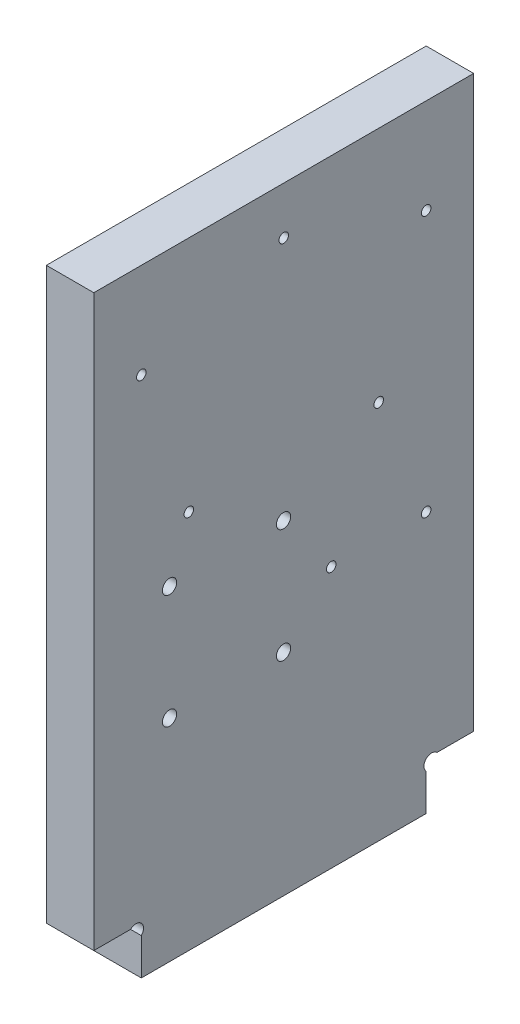
ISO-10303-21;
HEADER;
FILE_DESCRIPTION(('STEP AP214'),'2;1');
FILE_NAME('part.step','',(''),(''),'','','');
FILE_SCHEMA(('AUTOMOTIVE_DESIGN { 1 0 10303 214 1 1 1 1 }'));
ENDSEC;
DATA;
#1=APPLICATION_CONTEXT('core data for automotive mechanical design processes');
#2=APPLICATION_PROTOCOL_DEFINITION('international standard','automotive_design',2000,#1);
#3=PRODUCT_CONTEXT('',#1,'mechanical');
#4=PRODUCT('Part','Part','',(#3));
#5=PRODUCT_RELATED_PRODUCT_CATEGORY('part','',(#4));
#6=PRODUCT_DEFINITION_FORMATION('','',#4);
#7=PRODUCT_DEFINITION_CONTEXT('part definition',#1,'design');
#8=PRODUCT_DEFINITION('design','',#6,#7);
#9=PRODUCT_DEFINITION_SHAPE('','',#8);
#10=(LENGTH_UNIT() NAMED_UNIT(*) SI_UNIT(.MILLI.,.METRE.));
#11=(NAMED_UNIT(*) PLANE_ANGLE_UNIT() SI_UNIT($,.RADIAN.));
#12=(NAMED_UNIT(*) SI_UNIT($,.STERADIAN.) SOLID_ANGLE_UNIT());
#13=UNCERTAINTY_MEASURE_WITH_UNIT(LENGTH_MEASURE(1.E-05),#10,'distance_accuracy_value','');
#14=(GEOMETRIC_REPRESENTATION_CONTEXT(3) GLOBAL_UNCERTAINTY_ASSIGNED_CONTEXT((#13)) GLOBAL_UNIT_ASSIGNED_CONTEXT((#10,
#11,#12)) REPRESENTATION_CONTEXT('',''));
#15=CARTESIAN_POINT('',(0.,0.,0.));
#16=DIRECTION('',(0.,0.,1.));
#17=DIRECTION('',(1.,0.,0.));
#18=AXIS2_PLACEMENT_3D('',#15,#16,#17);
#19=CARTESIAN_POINT('',(10.,8.86862915010153,-8.86862915010152));
#20=DIRECTION('',(-1.,0.,0.));
#21=DIRECTION('',(0.,0.,1.));
#22=AXIS2_PLACEMENT_3D('',#19,#20,#21);
#23=CYLINDRICAL_SURFACE('',#22,1.6);
#24=CARTESIAN_POINT('',(0.,8.86862915010153,-8.86862915010152));
#25=DIRECTION('',(-1.,0.,0.));
#26=DIRECTION('',(0.,0.,-1.));
#27=AXIS2_PLACEMENT_3D('',#24,#25,#26);
#28=CIRCLE('',#27,1.6);
#29=CARTESIAN_POINT('',(0.,10.,-7.73725830020304));
#30=VERTEX_POINT('',#29);
#31=CARTESIAN_POINT('',(0.,7.73725830020305,-10.));
#32=VERTEX_POINT('',#31);
#33=EDGE_CURVE('E143',#30,#32,#28,.T.);
#34=ORIENTED_EDGE('',*,*,#33,.T.);
#35=DIRECTION('',(-1.,0.,0.));
#36=VECTOR('',#35,1.);
#37=CARTESIAN_POINT('',(10.,7.73725830020305,-10.));
#38=LINE('',#37,#36);
#39=CARTESIAN_POINT('',(10.,7.73725830020305,-10.));
#40=VERTEX_POINT('',#39);
#41=EDGE_CURVE('E11',#40,#32,#38,.T.);
#42=ORIENTED_EDGE('',*,*,#41,.F.);
#43=CARTESIAN_POINT('',(10.,8.86862915010153,-8.86862915010152));
#44=DIRECTION('',(-1.,0.,0.));
#45=DIRECTION('',(0.,0.,-1.));
#46=AXIS2_PLACEMENT_3D('',#43,#44,#45);
#47=CIRCLE('',#46,1.6);
#48=CARTESIAN_POINT('',(10.,10.,-7.73725830020304));
#49=VERTEX_POINT('',#48);
#50=EDGE_CURVE('E162',#49,#40,#47,.T.);
#51=ORIENTED_EDGE('',*,*,#50,.F.);
#52=DIRECTION('',(-1.,0.,0.));
#53=VECTOR('',#52,1.);
#54=CARTESIAN_POINT('',(10.,10.,-7.73725830020304));
#55=LINE('',#54,#53);
#56=EDGE_CURVE('E139',#49,#30,#55,.T.);
#57=ORIENTED_EDGE('',*,*,#56,.T.);
#58=EDGE_LOOP('',(#34,#42,#51,#57));
#59=FACE_BOUND('',#58,.T.);
#60=ADVANCED_FACE('F35',(#59),#23,.F.);
#61=CARTESIAN_POINT('',(10.,7.73725830020305,-10.));
#62=DIRECTION('',(0.,0.,-1.));
#63=DIRECTION('',(-1.,0.,0.));
#64=AXIS2_PLACEMENT_3D('',#61,#62,#63);
#65=PLANE('',#64);
#66=DIRECTION('',(0.,-1.,0.));
#67=VECTOR('',#66,1.);
#68=CARTESIAN_POINT('',(0.,7.73725830020305,-10.));
#69=LINE('',#68,#67);
#70=CARTESIAN_POINT('',(0.,0.,-10.));
#71=VERTEX_POINT('',#70);
#72=EDGE_CURVE('E146',#32,#71,#69,.T.);
#73=ORIENTED_EDGE('',*,*,#72,.T.);
#74=DIRECTION('',(-1.,0.,0.));
#75=VECTOR('',#74,1.);
#76=CARTESIAN_POINT('',(10.,0.,-10.));
#77=LINE('',#76,#75);
#78=CARTESIAN_POINT('',(10.,0.,-10.));
#79=VERTEX_POINT('',#78);
#80=EDGE_CURVE('E43',#79,#71,#77,.T.);
#81=ORIENTED_EDGE('',*,*,#80,.F.);
#82=DIRECTION('',(0.,-1.,0.));
#83=VECTOR('',#82,1.);
#84=CARTESIAN_POINT('',(10.,7.73725830020305,-10.));
#85=LINE('',#84,#83);
#86=EDGE_CURVE('E100',#40,#79,#85,.T.);
#87=ORIENTED_EDGE('',*,*,#86,.F.);
#88=ORIENTED_EDGE('',*,*,#41,.T.);
#89=EDGE_LOOP('',(#73,#81,#87,#88));
#90=FACE_BOUND('',#89,.T.);
#91=ADVANCED_FACE('F323',(#90),#65,.F.);
#92=CARTESIAN_POINT('',(10.,0.,-10.));
#93=DIRECTION('',(0.,1.,0.));
#94=DIRECTION('',(0.,0.,1.));
#95=AXIS2_PLACEMENT_3D('',#92,#93,#94);
#96=PLANE('',#95);
#97=DIRECTION('',(0.,0.,-1.));
#98=VECTOR('',#97,1.);
#99=CARTESIAN_POINT('',(0.,0.,-10.));
#100=LINE('',#99,#98);
#101=CARTESIAN_POINT('',(0.,0.,-70.));
#102=VERTEX_POINT('',#101);
#103=EDGE_CURVE('E149',#71,#102,#100,.T.);
#104=ORIENTED_EDGE('',*,*,#103,.T.);
#105=DIRECTION('',(-1.,0.,0.));
#106=VECTOR('',#105,1.);
#107=CARTESIAN_POINT('',(10.,0.,-70.));
#108=LINE('',#107,#106);
#109=CARTESIAN_POINT('',(10.,0.,-70.));
#110=VERTEX_POINT('',#109);
#111=EDGE_CURVE('E175',#110,#102,#108,.T.);
#112=ORIENTED_EDGE('',*,*,#111,.F.);
#113=DIRECTION('',(0.,0.,-1.));
#114=VECTOR('',#113,1.);
#115=CARTESIAN_POINT('',(10.,0.,-10.));
#116=LINE('',#115,#114);
#117=EDGE_CURVE('E183',#79,#110,#116,.T.);
#118=ORIENTED_EDGE('',*,*,#117,.F.);
#119=ORIENTED_EDGE('',*,*,#80,.T.);
#120=EDGE_LOOP('',(#104,#112,#118,#119));
#121=FACE_BOUND('',#120,.T.);
#122=ADVANCED_FACE('F181',(#121),#96,.F.);
#123=CARTESIAN_POINT('',(10.,7.73725830020305,-70.));
#124=DIRECTION('',(0.,0.,1.));
#125=DIRECTION('',(1.,0.,0.));
#126=AXIS2_PLACEMENT_3D('',#123,#124,#125);
#127=PLANE('',#126);
#128=DIRECTION('',(0.,1.,0.));
#129=VECTOR('',#128,1.);
#130=CARTESIAN_POINT('',(0.,7.73725830020305,-70.));
#131=LINE('',#130,#129);
#132=CARTESIAN_POINT('',(0.,7.73725830020305,-70.));
#133=VERTEX_POINT('',#132);
#134=EDGE_CURVE('E151',#102,#133,#131,.T.);
#135=ORIENTED_EDGE('',*,*,#134,.T.);
#136=DIRECTION('',(-1.,0.,0.));
#137=VECTOR('',#136,1.);
#138=CARTESIAN_POINT('',(10.,7.73725830020305,-70.));
#139=LINE('',#138,#137);
#140=CARTESIAN_POINT('',(10.,7.73725830020305,-70.));
#141=VERTEX_POINT('',#140);
#142=EDGE_CURVE('E172',#141,#133,#139,.T.);
#143=ORIENTED_EDGE('',*,*,#142,.F.);
#144=DIRECTION('',(0.,1.,0.));
#145=VECTOR('',#144,1.);
#146=CARTESIAN_POINT('',(10.,7.73725830020305,-70.));
#147=LINE('',#146,#145);
#148=EDGE_CURVE('E201',#110,#141,#147,.T.);
#149=ORIENTED_EDGE('',*,*,#148,.F.);
#150=ORIENTED_EDGE('',*,*,#111,.T.);
#151=EDGE_LOOP('',(#135,#143,#149,#150));
#152=FACE_BOUND('',#151,.T.);
#153=ADVANCED_FACE('F192',(#152),#127,.F.);
#154=CARTESIAN_POINT('',(10.,8.86862915010153,-71.1313708498985));
#155=DIRECTION('',(-1.,0.,0.));
#156=DIRECTION('',(0.,0.,1.));
#157=AXIS2_PLACEMENT_3D('',#154,#155,#156);
#158=CYLINDRICAL_SURFACE('',#157,1.6);
#159=CARTESIAN_POINT('',(0.,8.86862915010153,-71.1313708498985));
#160=DIRECTION('',(-1.,0.,0.));
#161=DIRECTION('',(0.,0.,1.));
#162=AXIS2_PLACEMENT_3D('',#159,#160,#161);
#163=CIRCLE('',#162,1.6);
#164=CARTESIAN_POINT('',(0.,10.,-72.262741699797));
#165=VERTEX_POINT('',#164);
#166=EDGE_CURVE('E153',#133,#165,#163,.T.);
#167=ORIENTED_EDGE('',*,*,#166,.T.);
#168=DIRECTION('',(-1.,0.,0.));
#169=VECTOR('',#168,1.);
#170=CARTESIAN_POINT('',(10.,10.,-72.262741699797));
#171=LINE('',#170,#169);
#172=CARTESIAN_POINT('',(10.,10.,-72.262741699797));
#173=VERTEX_POINT('',#172);
#174=EDGE_CURVE('E169',#173,#165,#171,.T.);
#175=ORIENTED_EDGE('',*,*,#174,.F.);
#176=CARTESIAN_POINT('',(10.,8.86862915010153,-71.1313708498985));
#177=DIRECTION('',(-1.,0.,0.));
#178=DIRECTION('',(0.,0.,1.));
#179=AXIS2_PLACEMENT_3D('',#176,#177,#178);
#180=CIRCLE('',#179,1.6);
#181=EDGE_CURVE('E198',#141,#173,#180,.T.);
#182=ORIENTED_EDGE('',*,*,#181,.F.);
#183=ORIENTED_EDGE('',*,*,#142,.T.);
#184=EDGE_LOOP('',(#167,#175,#182,#183));
#185=FACE_BOUND('',#184,.T.);
#186=ADVANCED_FACE('F196',(#185),#158,.F.);
#187=CARTESIAN_POINT('',(10.,10.,-72.262741699797));
#188=DIRECTION('',(0.,1.,0.));
#189=DIRECTION('',(0.,0.,1.));
#190=AXIS2_PLACEMENT_3D('',#187,#188,#189);
#191=PLANE('',#190);
#192=DIRECTION('',(0.,0.,-1.));
#193=VECTOR('',#192,1.);
#194=CARTESIAN_POINT('',(0.,10.,-72.262741699797));
#195=LINE('',#194,#193);
#196=CARTESIAN_POINT('',(0.,10.,-80.));
#197=VERTEX_POINT('',#196);
#198=EDGE_CURVE('E155',#165,#197,#195,.T.);
#199=ORIENTED_EDGE('',*,*,#198,.T.);
#200=DIRECTION('',(-1.,0.,0.));
#201=VECTOR('',#200,1.);
#202=CARTESIAN_POINT('',(10.,10.,-80.));
#203=LINE('',#202,#201);
#204=CARTESIAN_POINT('',(10.,10.,-80.));
#205=VERTEX_POINT('',#204);
#206=EDGE_CURVE('E166',#205,#197,#203,.T.);
#207=ORIENTED_EDGE('',*,*,#206,.F.);
#208=DIRECTION('',(0.,0.,-1.));
#209=VECTOR('',#208,1.);
#210=CARTESIAN_POINT('',(10.,10.,-72.262741699797));
#211=LINE('',#210,#209);
#212=EDGE_CURVE('E200',#173,#205,#211,.T.);
#213=ORIENTED_EDGE('',*,*,#212,.F.);
#214=ORIENTED_EDGE('',*,*,#174,.T.);
#215=EDGE_LOOP('',(#199,#207,#213,#214));
#216=FACE_BOUND('',#215,.T.);
#217=ADVANCED_FACE('F335',(#216),#191,.F.);
#218=CARTESIAN_POINT('',(10.,130.,-80.));
#219=DIRECTION('',(0.,0.,1.));
#220=DIRECTION('',(1.,0.,0.));
#221=AXIS2_PLACEMENT_3D('',#218,#219,#220);
#222=PLANE('',#221);
#223=DIRECTION('',(0.,1.,0.));
#224=VECTOR('',#223,1.);
#225=CARTESIAN_POINT('',(0.,130.,-80.));
#226=LINE('',#225,#224);
#227=CARTESIAN_POINT('',(0.,130.,-80.));
#228=VERTEX_POINT('',#227);
#229=EDGE_CURVE('E157',#197,#228,#226,.T.);
#230=ORIENTED_EDGE('',*,*,#229,.T.);
#231=DIRECTION('',(-1.,0.,0.));
#232=VECTOR('',#231,1.);
#233=CARTESIAN_POINT('',(10.,130.,-80.));
#234=LINE('',#233,#232);
#235=CARTESIAN_POINT('',(10.,130.,-80.));
#236=VERTEX_POINT('',#235);
#237=EDGE_CURVE('E134',#236,#228,#234,.T.);
#238=ORIENTED_EDGE('',*,*,#237,.F.);
#239=DIRECTION('',(0.,1.,0.));
#240=VECTOR('',#239,1.);
#241=CARTESIAN_POINT('',(10.,130.,-80.));
#242=LINE('',#241,#240);
#243=EDGE_CURVE('E125',#205,#236,#242,.T.);
#244=ORIENTED_EDGE('',*,*,#243,.F.);
#245=ORIENTED_EDGE('',*,*,#206,.T.);
#246=EDGE_LOOP('',(#230,#238,#244,#245));
#247=FACE_BOUND('',#246,.T.);
#248=ADVANCED_FACE('F332',(#247),#222,.F.);
#249=CARTESIAN_POINT('',(10.,130.,0.));
#250=DIRECTION('',(0.,-1.,0.));
#251=DIRECTION('',(0.,0.,-1.));
#252=AXIS2_PLACEMENT_3D('',#249,#250,#251);
#253=PLANE('',#252);
#254=DIRECTION('',(0.,0.,1.));
#255=VECTOR('',#254,1.);
#256=CARTESIAN_POINT('',(0.,130.,0.));
#257=LINE('',#256,#255);
#258=CARTESIAN_POINT('',(0.,130.,0.));
#259=VERTEX_POINT('',#258);
#260=EDGE_CURVE('E133',#228,#259,#257,.T.);
#261=ORIENTED_EDGE('',*,*,#260,.T.);
#262=DIRECTION('',(-1.,0.,0.));
#263=VECTOR('',#262,1.);
#264=CARTESIAN_POINT('',(10.,130.,0.));
#265=LINE('',#264,#263);
#266=CARTESIAN_POINT('',(10.,130.,0.));
#267=VERTEX_POINT('',#266);
#268=EDGE_CURVE('E130',#267,#259,#265,.T.);
#269=ORIENTED_EDGE('',*,*,#268,.F.);
#270=DIRECTION('',(0.,0.,1.));
#271=VECTOR('',#270,1.);
#272=CARTESIAN_POINT('',(10.,130.,0.));
#273=LINE('',#272,#271);
#274=EDGE_CURVE('E119',#236,#267,#273,.T.);
#275=ORIENTED_EDGE('',*,*,#274,.F.);
#276=ORIENTED_EDGE('',*,*,#237,.T.);
#277=EDGE_LOOP('',(#261,#269,#275,#276));
#278=FACE_BOUND('',#277,.T.);
#279=ADVANCED_FACE('F131',(#278),#253,.F.);
#280=CARTESIAN_POINT('',(10.,10.,0.));
#281=DIRECTION('',(0.,0.,-1.));
#282=DIRECTION('',(-1.,0.,0.));
#283=AXIS2_PLACEMENT_3D('',#280,#281,#282);
#284=PLANE('',#283);
#285=DIRECTION('',(0.,-1.,0.));
#286=VECTOR('',#285,1.);
#287=CARTESIAN_POINT('',(0.,10.,0.));
#288=LINE('',#287,#286);
#289=CARTESIAN_POINT('',(0.,10.,0.));
#290=VERTEX_POINT('',#289);
#291=EDGE_CURVE('E86',#259,#290,#288,.T.);
#292=ORIENTED_EDGE('',*,*,#291,.T.);
#293=DIRECTION('',(-1.,0.,0.));
#294=VECTOR('',#293,1.);
#295=CARTESIAN_POINT('',(10.,10.,0.));
#296=LINE('',#295,#294);
#297=CARTESIAN_POINT('',(10.,10.,0.));
#298=VERTEX_POINT('',#297);
#299=EDGE_CURVE('E135',#298,#290,#296,.T.);
#300=ORIENTED_EDGE('',*,*,#299,.F.);
#301=DIRECTION('',(0.,-1.,0.));
#302=VECTOR('',#301,1.);
#303=CARTESIAN_POINT('',(10.,10.,0.));
#304=LINE('',#303,#302);
#305=EDGE_CURVE('E123',#267,#298,#304,.T.);
#306=ORIENTED_EDGE('',*,*,#305,.F.);
#307=ORIENTED_EDGE('',*,*,#268,.T.);
#308=EDGE_LOOP('',(#292,#300,#306,#307));
#309=FACE_BOUND('',#308,.T.);
#310=ADVANCED_FACE('F137',(#309),#284,.F.);
#311=CARTESIAN_POINT('',(10.,10.,-7.73725830020304));
#312=DIRECTION('',(0.,1.,0.));
#313=DIRECTION('',(0.,0.,1.));
#314=AXIS2_PLACEMENT_3D('',#311,#312,#313);
#315=PLANE('',#314);
#316=DIRECTION('',(0.,0.,-1.));
#317=VECTOR('',#316,1.);
#318=CARTESIAN_POINT('',(0.,10.,-7.73725830020304));
#319=LINE('',#318,#317);
#320=EDGE_CURVE('E92',#290,#30,#319,.T.);
#321=ORIENTED_EDGE('',*,*,#320,.T.);
#322=ORIENTED_EDGE('',*,*,#56,.F.);
#323=DIRECTION('',(0.,0.,-1.));
#324=VECTOR('',#323,1.);
#325=CARTESIAN_POINT('',(10.,10.,-7.73725830020304));
#326=LINE('',#325,#324);
#327=EDGE_CURVE('E51',#298,#49,#326,.T.);
#328=ORIENTED_EDGE('',*,*,#327,.F.);
#329=ORIENTED_EDGE('',*,*,#299,.T.);
#330=EDGE_LOOP('',(#321,#322,#328,#329));
#331=FACE_BOUND('',#330,.T.);
#332=ADVANCED_FACE('F286',(#331),#315,.F.);
#333=CARTESIAN_POINT('',(10.,8.86862915010153,-8.86862915010152));
#334=DIRECTION('',(1.,0.,0.));
#335=DIRECTION('',(0.,0.,-1.));
#336=AXIS2_PLACEMENT_3D('',#333,#334,#335);
#337=PLANE('',#336);
#338=CARTESIAN_POINT('',(10.,68.45,-39.95));
#339=DIRECTION('',(1.,0.,0.));
#340=DIRECTION('',(0.,0.,-1.));
#341=AXIS2_PLACEMENT_3D('',#338,#339,#340);
#342=CIRCLE('',#341,1.5);
#343=CARTESIAN_POINT('',(10.,68.45,-41.45));
#344=VERTEX_POINT('',#343);
#345=EDGE_CURVE('E269',#344,#344,#342,.T.);
#346=ORIENTED_EDGE('',*,*,#345,.F.);
#347=EDGE_LOOP('',(#346));
#348=FACE_BOUND('',#347,.T.);
#349=CARTESIAN_POINT('',(10.,44.45,-39.95));
#350=DIRECTION('',(1.,0.,0.));
#351=DIRECTION('',(0.,0.,-1.));
#352=AXIS2_PLACEMENT_3D('',#349,#350,#351);
#353=CIRCLE('',#352,1.5);
#354=CARTESIAN_POINT('',(10.,44.45,-41.45));
#355=VERTEX_POINT('',#354);
#356=EDGE_CURVE('E263',#355,#355,#353,.T.);
#357=ORIENTED_EDGE('',*,*,#356,.F.);
#358=EDGE_LOOP('',(#357));
#359=FACE_BOUND('',#358,.T.);
#360=CARTESIAN_POINT('',(10.,44.45,-15.95));
#361=DIRECTION('',(1.,0.,0.));
#362=DIRECTION('',(0.,0.,-1.));
#363=AXIS2_PLACEMENT_3D('',#360,#361,#362);
#364=CIRCLE('',#363,1.5);
#365=CARTESIAN_POINT('',(10.,44.45,-17.45));
#366=VERTEX_POINT('',#365);
#367=EDGE_CURVE('E257',#366,#366,#364,.T.);
#368=ORIENTED_EDGE('',*,*,#367,.F.);
#369=EDGE_LOOP('',(#368));
#370=FACE_BOUND('',#369,.T.);
#371=CARTESIAN_POINT('',(10.,68.45,-15.95));
#372=DIRECTION('',(1.,0.,0.));
#373=DIRECTION('',(0.,0.,-1.));
#374=AXIS2_PLACEMENT_3D('',#371,#372,#373);
#375=CIRCLE('',#374,1.5);
#376=CARTESIAN_POINT('',(10.,68.45,-17.45));
#377=VERTEX_POINT('',#376);
#378=EDGE_CURVE('E251',#377,#377,#375,.T.);
#379=ORIENTED_EDGE('',*,*,#378,.F.);
#380=EDGE_LOOP('',(#379));
#381=FACE_BOUND('',#380,.T.);
#382=CARTESIAN_POINT('',(10.,120.,-40.));
#383=DIRECTION('',(1.,0.,0.));
#384=DIRECTION('',(0.,0.,-1.));
#385=AXIS2_PLACEMENT_3D('',#382,#383,#384);
#386=CIRCLE('',#385,0.999999999999998);
#387=CARTESIAN_POINT('',(10.,120.,-41.));
#388=VERTEX_POINT('',#387);
#389=EDGE_CURVE('E245',#388,#388,#386,.T.);
#390=ORIENTED_EDGE('',*,*,#389,.F.);
#391=EDGE_LOOP('',(#390));
#392=FACE_BOUND('',#391,.T.);
#393=CARTESIAN_POINT('',(10.,80.,-20.));
#394=DIRECTION('',(1.,0.,0.));
#395=DIRECTION('',(0.,0.,1.));
#396=AXIS2_PLACEMENT_3D('',#393,#394,#395);
#397=CIRCLE('',#396,1.);
#398=CARTESIAN_POINT('',(10.,80.,-19.));
#399=VERTEX_POINT('',#398);
#400=EDGE_CURVE('E239',#399,#399,#397,.T.);
#401=ORIENTED_EDGE('',*,*,#400,.F.);
#402=EDGE_LOOP('',(#401));
#403=FACE_BOUND('',#402,.T.);
#404=CARTESIAN_POINT('',(10.,55.,-70.));
#405=DIRECTION('',(1.,0.,0.));
#406=DIRECTION('',(0.,0.,-1.));
#407=AXIS2_PLACEMENT_3D('',#404,#405,#406);
#408=CIRCLE('',#407,0.999999999999998);
#409=CARTESIAN_POINT('',(10.,55.,-71.));
#410=VERTEX_POINT('',#409);
#411=EDGE_CURVE('E233',#410,#410,#408,.T.);
#412=ORIENTED_EDGE('',*,*,#411,.F.);
#413=EDGE_LOOP('',(#412));
#414=FACE_BOUND('',#413,.T.);
#415=CARTESIAN_POINT('',(10.,55.,-50.));
#416=DIRECTION('',(1.,0.,0.));
#417=DIRECTION('',(0.,0.,-1.));
#418=AXIS2_PLACEMENT_3D('',#415,#416,#417);
#419=CIRCLE('',#418,0.999999999999998);
#420=CARTESIAN_POINT('',(10.,55.,-51.));
#421=VERTEX_POINT('',#420);
#422=EDGE_CURVE('E227',#421,#421,#419,.T.);
#423=ORIENTED_EDGE('',*,*,#422,.F.);
#424=EDGE_LOOP('',(#423));
#425=FACE_BOUND('',#424,.T.);
#426=CARTESIAN_POINT('',(10.,110.,-70.));
#427=DIRECTION('',(1.,0.,0.));
#428=DIRECTION('',(0.,0.,-1.));
#429=AXIS2_PLACEMENT_3D('',#426,#427,#428);
#430=CIRCLE('',#429,0.999999999999998);
#431=CARTESIAN_POINT('',(10.,110.,-71.));
#432=VERTEX_POINT('',#431);
#433=EDGE_CURVE('E221',#432,#432,#430,.T.);
#434=ORIENTED_EDGE('',*,*,#433,.F.);
#435=EDGE_LOOP('',(#434));
#436=FACE_BOUND('',#435,.T.);
#437=CARTESIAN_POINT('',(10.,80.,-60.));
#438=DIRECTION('',(1.,0.,0.));
#439=DIRECTION('',(0.,0.,-1.));
#440=AXIS2_PLACEMENT_3D('',#437,#438,#439);
#441=CIRCLE('',#440,0.999999999999998);
#442=CARTESIAN_POINT('',(10.,80.,-61.));
#443=VERTEX_POINT('',#442);
#444=EDGE_CURVE('E215',#443,#443,#441,.T.);
#445=ORIENTED_EDGE('',*,*,#444,.F.);
#446=EDGE_LOOP('',(#445));
#447=FACE_BOUND('',#446,.T.);
#448=CARTESIAN_POINT('',(10.,110.,-10.));
#449=DIRECTION('',(1.,0.,0.));
#450=DIRECTION('',(0.,0.,-1.));
#451=AXIS2_PLACEMENT_3D('',#448,#449,#450);
#452=CIRCLE('',#451,1.);
#453=CARTESIAN_POINT('',(10.,110.,-11.));
#454=VERTEX_POINT('',#453);
#455=EDGE_CURVE('E209',#454,#454,#452,.T.);
#456=ORIENTED_EDGE('',*,*,#455,.F.);
#457=EDGE_LOOP('',(#456));
#458=FACE_BOUND('',#457,.T.);
#459=ORIENTED_EDGE('',*,*,#50,.T.);
#460=ORIENTED_EDGE('',*,*,#86,.T.);
#461=ORIENTED_EDGE('',*,*,#117,.T.);
#462=ORIENTED_EDGE('',*,*,#148,.T.);
#463=ORIENTED_EDGE('',*,*,#181,.T.);
#464=ORIENTED_EDGE('',*,*,#212,.T.);
#465=ORIENTED_EDGE('',*,*,#243,.T.);
#466=ORIENTED_EDGE('',*,*,#274,.T.);
#467=ORIENTED_EDGE('',*,*,#305,.T.);
#468=ORIENTED_EDGE('',*,*,#327,.T.);
#469=EDGE_LOOP('',(#459,#460,#461,#462,#463,#464,#465,#466,#467,#468));
#470=FACE_BOUND('',#469,.T.);
#471=ADVANCED_FACE('F121',(#348,#359,#370,#381,#392,#403,#414,#425,#436,#447,#458,#470),#337,.T.);
#472=CARTESIAN_POINT('',(0.,8.86862915010153,-8.86862915010152));
#473=DIRECTION('',(1.,0.,0.));
#474=DIRECTION('',(0.,0.,-1.));
#475=AXIS2_PLACEMENT_3D('',#472,#473,#474);
#476=PLANE('',#475);
#477=CARTESIAN_POINT('',(0.,68.45,-39.95));
#478=DIRECTION('',(1.,0.,0.));
#479=DIRECTION('',(0.,0.,-1.));
#480=AXIS2_PLACEMENT_3D('',#477,#478,#479);
#481=CIRCLE('',#480,1.5);
#482=CARTESIAN_POINT('',(0.,68.45,-41.45));
#483=VERTEX_POINT('',#482);
#484=EDGE_CURVE('E266',#483,#483,#481,.T.);
#485=ORIENTED_EDGE('',*,*,#484,.T.);
#486=EDGE_LOOP('',(#485));
#487=FACE_BOUND('',#486,.T.);
#488=CARTESIAN_POINT('',(0.,44.45,-39.95));
#489=DIRECTION('',(1.,0.,0.));
#490=DIRECTION('',(0.,0.,-1.));
#491=AXIS2_PLACEMENT_3D('',#488,#489,#490);
#492=CIRCLE('',#491,1.5);
#493=CARTESIAN_POINT('',(0.,44.45,-41.45));
#494=VERTEX_POINT('',#493);
#495=EDGE_CURVE('E260',#494,#494,#492,.T.);
#496=ORIENTED_EDGE('',*,*,#495,.T.);
#497=EDGE_LOOP('',(#496));
#498=FACE_BOUND('',#497,.T.);
#499=CARTESIAN_POINT('',(0.,44.45,-15.95));
#500=DIRECTION('',(1.,0.,0.));
#501=DIRECTION('',(0.,0.,-1.));
#502=AXIS2_PLACEMENT_3D('',#499,#500,#501);
#503=CIRCLE('',#502,1.5);
#504=CARTESIAN_POINT('',(0.,44.45,-17.45));
#505=VERTEX_POINT('',#504);
#506=EDGE_CURVE('E254',#505,#505,#503,.T.);
#507=ORIENTED_EDGE('',*,*,#506,.T.);
#508=EDGE_LOOP('',(#507));
#509=FACE_BOUND('',#508,.T.);
#510=CARTESIAN_POINT('',(0.,68.45,-15.95));
#511=DIRECTION('',(1.,0.,0.));
#512=DIRECTION('',(0.,0.,-1.));
#513=AXIS2_PLACEMENT_3D('',#510,#511,#512);
#514=CIRCLE('',#513,1.5);
#515=CARTESIAN_POINT('',(0.,68.45,-17.45));
#516=VERTEX_POINT('',#515);
#517=EDGE_CURVE('E248',#516,#516,#514,.T.);
#518=ORIENTED_EDGE('',*,*,#517,.T.);
#519=EDGE_LOOP('',(#518));
#520=FACE_BOUND('',#519,.T.);
#521=CARTESIAN_POINT('',(0.,120.,-40.));
#522=DIRECTION('',(1.,0.,0.));
#523=DIRECTION('',(0.,0.,-1.));
#524=AXIS2_PLACEMENT_3D('',#521,#522,#523);
#525=CIRCLE('',#524,0.999999999999998);
#526=CARTESIAN_POINT('',(0.,120.,-41.));
#527=VERTEX_POINT('',#526);
#528=EDGE_CURVE('E242',#527,#527,#525,.T.);
#529=ORIENTED_EDGE('',*,*,#528,.T.);
#530=EDGE_LOOP('',(#529));
#531=FACE_BOUND('',#530,.T.);
#532=CARTESIAN_POINT('',(0.,80.,-20.));
#533=DIRECTION('',(1.,0.,0.));
#534=DIRECTION('',(0.,0.,1.));
#535=AXIS2_PLACEMENT_3D('',#532,#533,#534);
#536=CIRCLE('',#535,1.);
#537=CARTESIAN_POINT('',(0.,80.,-19.));
#538=VERTEX_POINT('',#537);
#539=EDGE_CURVE('E236',#538,#538,#536,.T.);
#540=ORIENTED_EDGE('',*,*,#539,.T.);
#541=EDGE_LOOP('',(#540));
#542=FACE_BOUND('',#541,.T.);
#543=CARTESIAN_POINT('',(0.,55.,-70.));
#544=DIRECTION('',(1.,0.,0.));
#545=DIRECTION('',(0.,0.,-1.));
#546=AXIS2_PLACEMENT_3D('',#543,#544,#545);
#547=CIRCLE('',#546,0.999999999999998);
#548=CARTESIAN_POINT('',(0.,55.,-71.));
#549=VERTEX_POINT('',#548);
#550=EDGE_CURVE('E230',#549,#549,#547,.T.);
#551=ORIENTED_EDGE('',*,*,#550,.T.);
#552=EDGE_LOOP('',(#551));
#553=FACE_BOUND('',#552,.T.);
#554=CARTESIAN_POINT('',(0.,55.,-50.));
#555=DIRECTION('',(1.,0.,0.));
#556=DIRECTION('',(0.,0.,-1.));
#557=AXIS2_PLACEMENT_3D('',#554,#555,#556);
#558=CIRCLE('',#557,0.999999999999998);
#559=CARTESIAN_POINT('',(0.,55.,-51.));
#560=VERTEX_POINT('',#559);
#561=EDGE_CURVE('E224',#560,#560,#558,.T.);
#562=ORIENTED_EDGE('',*,*,#561,.T.);
#563=EDGE_LOOP('',(#562));
#564=FACE_BOUND('',#563,.T.);
#565=CARTESIAN_POINT('',(0.,110.,-70.));
#566=DIRECTION('',(1.,0.,0.));
#567=DIRECTION('',(0.,0.,-1.));
#568=AXIS2_PLACEMENT_3D('',#565,#566,#567);
#569=CIRCLE('',#568,0.999999999999998);
#570=CARTESIAN_POINT('',(0.,110.,-71.));
#571=VERTEX_POINT('',#570);
#572=EDGE_CURVE('E218',#571,#571,#569,.T.);
#573=ORIENTED_EDGE('',*,*,#572,.T.);
#574=EDGE_LOOP('',(#573));
#575=FACE_BOUND('',#574,.T.);
#576=CARTESIAN_POINT('',(0.,80.,-60.));
#577=DIRECTION('',(1.,0.,0.));
#578=DIRECTION('',(0.,0.,-1.));
#579=AXIS2_PLACEMENT_3D('',#576,#577,#578);
#580=CIRCLE('',#579,0.999999999999998);
#581=CARTESIAN_POINT('',(0.,80.,-61.));
#582=VERTEX_POINT('',#581);
#583=EDGE_CURVE('E212',#582,#582,#580,.T.);
#584=ORIENTED_EDGE('',*,*,#583,.T.);
#585=EDGE_LOOP('',(#584));
#586=FACE_BOUND('',#585,.T.);
#587=CARTESIAN_POINT('',(0.,110.,-10.));
#588=DIRECTION('',(1.,0.,0.));
#589=DIRECTION('',(0.,0.,-1.));
#590=AXIS2_PLACEMENT_3D('',#587,#588,#589);
#591=CIRCLE('',#590,1.);
#592=CARTESIAN_POINT('',(0.,110.,-11.));
#593=VERTEX_POINT('',#592);
#594=EDGE_CURVE('E147',#593,#593,#591,.T.);
#595=ORIENTED_EDGE('',*,*,#594,.T.);
#596=EDGE_LOOP('',(#595));
#597=FACE_BOUND('',#596,.T.);
#598=ORIENTED_EDGE('',*,*,#33,.F.);
#599=ORIENTED_EDGE('',*,*,#320,.F.);
#600=ORIENTED_EDGE('',*,*,#291,.F.);
#601=ORIENTED_EDGE('',*,*,#260,.F.);
#602=ORIENTED_EDGE('',*,*,#229,.F.);
#603=ORIENTED_EDGE('',*,*,#198,.F.);
#604=ORIENTED_EDGE('',*,*,#166,.F.);
#605=ORIENTED_EDGE('',*,*,#134,.F.);
#606=ORIENTED_EDGE('',*,*,#103,.F.);
#607=ORIENTED_EDGE('',*,*,#72,.F.);
#608=EDGE_LOOP('',(#598,#599,#600,#601,#602,#603,#604,#605,#606,#607));
#609=FACE_BOUND('',#608,.T.);
#610=ADVANCED_FACE('F187',(#487,#498,#509,#520,#531,#542,#553,#564,#575,#586,#597,#609),#476,.F.);
#611=CARTESIAN_POINT('',(0.,110.,-10.));
#612=DIRECTION('',(1.,0.,0.));
#613=DIRECTION('',(0.,0.,-1.));
#614=AXIS2_PLACEMENT_3D('',#611,#612,#613);
#615=CYLINDRICAL_SURFACE('',#614,1.);
#616=ORIENTED_EDGE('',*,*,#594,.F.);
#617=EDGE_LOOP('',(#616));
#618=FACE_BOUND('',#617,.T.);
#619=ORIENTED_EDGE('',*,*,#455,.T.);
#620=EDGE_LOOP('',(#619));
#621=FACE_BOUND('',#620,.T.);
#622=ADVANCED_FACE('F308',(#618,#621),#615,.F.);
#623=CARTESIAN_POINT('',(0.,80.,-60.));
#624=DIRECTION('',(1.,0.,0.));
#625=DIRECTION('',(0.,0.,-1.));
#626=AXIS2_PLACEMENT_3D('',#623,#624,#625);
#627=CYLINDRICAL_SURFACE('',#626,0.999999999999998);
#628=ORIENTED_EDGE('',*,*,#583,.F.);
#629=EDGE_LOOP('',(#628));
#630=FACE_BOUND('',#629,.T.);
#631=ORIENTED_EDGE('',*,*,#444,.T.);
#632=EDGE_LOOP('',(#631));
#633=FACE_BOUND('',#632,.T.);
#634=ADVANCED_FACE('F310',(#630,#633),#627,.F.);
#635=CARTESIAN_POINT('',(0.,110.,-70.));
#636=DIRECTION('',(1.,0.,0.));
#637=DIRECTION('',(0.,0.,-1.));
#638=AXIS2_PLACEMENT_3D('',#635,#636,#637);
#639=CYLINDRICAL_SURFACE('',#638,0.999999999999998);
#640=ORIENTED_EDGE('',*,*,#572,.F.);
#641=EDGE_LOOP('',(#640));
#642=FACE_BOUND('',#641,.T.);
#643=ORIENTED_EDGE('',*,*,#433,.T.);
#644=EDGE_LOOP('',(#643));
#645=FACE_BOUND('',#644,.T.);
#646=ADVANCED_FACE('F317',(#642,#645),#639,.F.);
#647=CARTESIAN_POINT('',(0.,55.,-50.));
#648=DIRECTION('',(1.,0.,0.));
#649=DIRECTION('',(0.,0.,-1.));
#650=AXIS2_PLACEMENT_3D('',#647,#648,#649);
#651=CYLINDRICAL_SURFACE('',#650,0.999999999999998);
#652=ORIENTED_EDGE('',*,*,#561,.F.);
#653=EDGE_LOOP('',(#652));
#654=FACE_BOUND('',#653,.T.);
#655=ORIENTED_EDGE('',*,*,#422,.T.);
#656=EDGE_LOOP('',(#655));
#657=FACE_BOUND('',#656,.T.);
#658=ADVANCED_FACE('F425',(#654,#657),#651,.F.);
#659=CARTESIAN_POINT('',(0.,55.,-70.));
#660=DIRECTION('',(1.,0.,0.));
#661=DIRECTION('',(0.,0.,-1.));
#662=AXIS2_PLACEMENT_3D('',#659,#660,#661);
#663=CYLINDRICAL_SURFACE('',#662,0.999999999999998);
#664=ORIENTED_EDGE('',*,*,#550,.F.);
#665=EDGE_LOOP('',(#664));
#666=FACE_BOUND('',#665,.T.);
#667=ORIENTED_EDGE('',*,*,#411,.T.);
#668=EDGE_LOOP('',(#667));
#669=FACE_BOUND('',#668,.T.);
#670=ADVANCED_FACE('F435',(#666,#669),#663,.F.);
#671=CARTESIAN_POINT('',(0.,80.,-20.));
#672=DIRECTION('',(1.,0.,0.));
#673=DIRECTION('',(0.,0.,-1.));
#674=AXIS2_PLACEMENT_3D('',#671,#672,#673);
#675=CYLINDRICAL_SURFACE('',#674,1.);
#676=ORIENTED_EDGE('',*,*,#539,.F.);
#677=EDGE_LOOP('',(#676));
#678=FACE_BOUND('',#677,.T.);
#679=ORIENTED_EDGE('',*,*,#400,.T.);
#680=EDGE_LOOP('',(#679));
#681=FACE_BOUND('',#680,.T.);
#682=ADVANCED_FACE('F445',(#678,#681),#675,.F.);
#683=CARTESIAN_POINT('',(0.,120.,-40.));
#684=DIRECTION('',(1.,0.,0.));
#685=DIRECTION('',(0.,0.,-1.));
#686=AXIS2_PLACEMENT_3D('',#683,#684,#685);
#687=CYLINDRICAL_SURFACE('',#686,0.999999999999998);
#688=ORIENTED_EDGE('',*,*,#528,.F.);
#689=EDGE_LOOP('',(#688));
#690=FACE_BOUND('',#689,.T.);
#691=ORIENTED_EDGE('',*,*,#389,.T.);
#692=EDGE_LOOP('',(#691));
#693=FACE_BOUND('',#692,.T.);
#694=ADVANCED_FACE('F455',(#690,#693),#687,.F.);
#695=CARTESIAN_POINT('',(0.,68.45,-15.95));
#696=DIRECTION('',(1.,0.,0.));
#697=DIRECTION('',(0.,0.,-1.));
#698=AXIS2_PLACEMENT_3D('',#695,#696,#697);
#699=CYLINDRICAL_SURFACE('',#698,1.5);
#700=ORIENTED_EDGE('',*,*,#517,.F.);
#701=EDGE_LOOP('',(#700));
#702=FACE_BOUND('',#701,.T.);
#703=ORIENTED_EDGE('',*,*,#378,.T.);
#704=EDGE_LOOP('',(#703));
#705=FACE_BOUND('',#704,.T.);
#706=ADVANCED_FACE('F465',(#702,#705),#699,.F.);
#707=CARTESIAN_POINT('',(0.,44.45,-15.95));
#708=DIRECTION('',(1.,0.,0.));
#709=DIRECTION('',(0.,0.,-1.));
#710=AXIS2_PLACEMENT_3D('',#707,#708,#709);
#711=CYLINDRICAL_SURFACE('',#710,1.5);
#712=ORIENTED_EDGE('',*,*,#506,.F.);
#713=EDGE_LOOP('',(#712));
#714=FACE_BOUND('',#713,.T.);
#715=ORIENTED_EDGE('',*,*,#367,.T.);
#716=EDGE_LOOP('',(#715));
#717=FACE_BOUND('',#716,.T.);
#718=ADVANCED_FACE('F475',(#714,#717),#711,.F.);
#719=CARTESIAN_POINT('',(0.,44.45,-39.95));
#720=DIRECTION('',(1.,0.,0.));
#721=DIRECTION('',(0.,0.,-1.));
#722=AXIS2_PLACEMENT_3D('',#719,#720,#721);
#723=CYLINDRICAL_SURFACE('',#722,1.5);
#724=ORIENTED_EDGE('',*,*,#495,.F.);
#725=EDGE_LOOP('',(#724));
#726=FACE_BOUND('',#725,.T.);
#727=ORIENTED_EDGE('',*,*,#356,.T.);
#728=EDGE_LOOP('',(#727));
#729=FACE_BOUND('',#728,.T.);
#730=ADVANCED_FACE('F280',(#726,#729),#723,.F.);
#731=CARTESIAN_POINT('',(0.,68.45,-39.95));
#732=DIRECTION('',(1.,0.,0.));
#733=DIRECTION('',(0.,0.,-1.));
#734=AXIS2_PLACEMENT_3D('',#731,#732,#733);
#735=CYLINDRICAL_SURFACE('',#734,1.5);
#736=ORIENTED_EDGE('',*,*,#484,.F.);
#737=EDGE_LOOP('',(#736));
#738=FACE_BOUND('',#737,.T.);
#739=ORIENTED_EDGE('',*,*,#345,.T.);
#740=EDGE_LOOP('',(#739));
#741=FACE_BOUND('',#740,.T.);
#742=ADVANCED_FACE('F277',(#738,#741),#735,.F.);
#743=CLOSED_SHELL('',(#60,#91,#122,#153,#186,#217,#248,#279,#310,#332,#471,#610,#622,#634,#646,
#658,#670,#682,#694,#706,#718,#730,#742));
#744=MANIFOLD_SOLID_BREP('B2',#743);
#745=ADVANCED_BREP_SHAPE_REPRESENTATION('',(#18,#744),#14);
#746=SHAPE_DEFINITION_REPRESENTATION(#9,#745);
ENDSEC;
END-ISO-10303-21;
